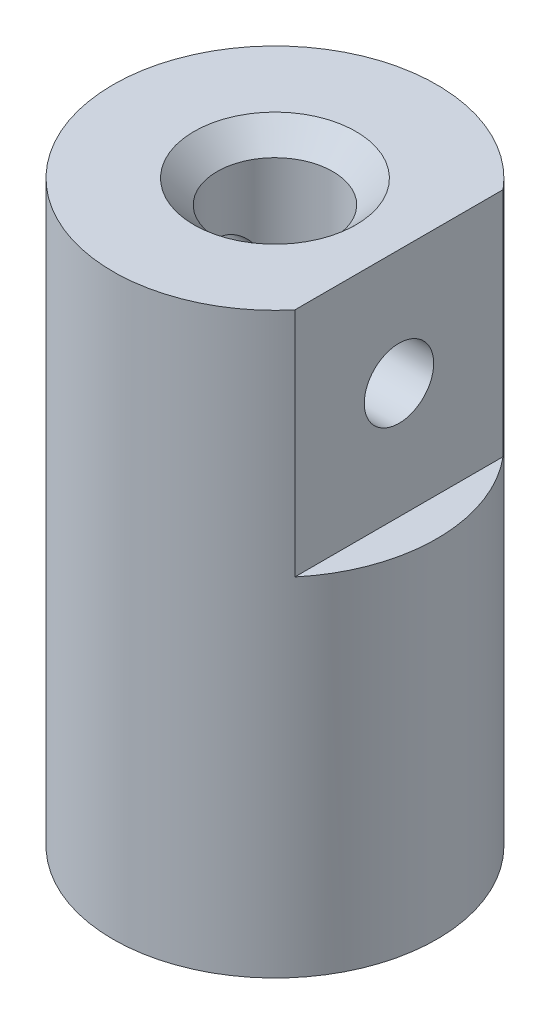
ISO-10303-21;
HEADER;
FILE_DESCRIPTION(('STEP AP214'),'2;1');
FILE_NAME('part.step','',(''),(''),'','','');
FILE_SCHEMA(('AUTOMOTIVE_DESIGN { 1 0 10303 214 1 1 1 1 }'));
ENDSEC;
DATA;
#1=APPLICATION_CONTEXT('core data for automotive mechanical design processes');
#2=APPLICATION_PROTOCOL_DEFINITION('international standard','automotive_design',2000,#1);
#3=PRODUCT_CONTEXT('',#1,'mechanical');
#4=PRODUCT('Part','Part','',(#3));
#5=PRODUCT_RELATED_PRODUCT_CATEGORY('part','',(#4));
#6=PRODUCT_DEFINITION_FORMATION('','',#4);
#7=PRODUCT_DEFINITION_CONTEXT('part definition',#1,'design');
#8=PRODUCT_DEFINITION('design','',#6,#7);
#9=PRODUCT_DEFINITION_SHAPE('','',#8);
#10=(LENGTH_UNIT() NAMED_UNIT(*) SI_UNIT(.MILLI.,.METRE.));
#11=(NAMED_UNIT(*) PLANE_ANGLE_UNIT() SI_UNIT($,.RADIAN.));
#12=(NAMED_UNIT(*) SI_UNIT($,.STERADIAN.) SOLID_ANGLE_UNIT());
#13=UNCERTAINTY_MEASURE_WITH_UNIT(LENGTH_MEASURE(1.E-05),#10,'distance_accuracy_value','');
#14=(GEOMETRIC_REPRESENTATION_CONTEXT(3) GLOBAL_UNCERTAINTY_ASSIGNED_CONTEXT((#13)) GLOBAL_UNIT_ASSIGNED_CONTEXT((#10,
#11,#12)) REPRESENTATION_CONTEXT('',''));
#15=CARTESIAN_POINT('',(0.,0.,0.));
#16=DIRECTION('',(0.,0.,1.));
#17=DIRECTION('',(1.,0.,0.));
#18=AXIS2_PLACEMENT_3D('',#15,#16,#17);
#19=CARTESIAN_POINT('',(0.,25.,0.));
#20=DIRECTION('',(0.,-1.,0.));
#21=DIRECTION('',(0.,0.,-1.));
#22=AXIS2_PLACEMENT_3D('',#19,#20,#21);
#23=CYLINDRICAL_SURFACE('',#22,7.);
#24=CARTESIAN_POINT('',(-7.,18.5,0.));
#25=CARTESIAN_POINT('',(-6.99999846043225,18.5000028995743,-0.0832358860906164));
#26=CARTESIAN_POINT('',(-6.9985002594971,18.5069516083879,-0.166507195600274));
#27=CARTESIAN_POINT('',(-6.99266829827728,18.5345356568536,-0.330687344293327));
#28=CARTESIAN_POINT('',(-6.98833245637099,18.5551810441949,-0.41159440357119));
#29=CARTESIAN_POINT('',(-6.97730831788826,18.609484364608,-0.568649323817737));
#30=CARTESIAN_POINT('',(-6.97062242967171,18.6431289793813,-0.644801963446556));
#31=CARTESIAN_POINT('',(-6.95562106817971,18.7224340861713,-0.790378177960788));
#32=CARTESIAN_POINT('',(-6.9473056503666,18.7680941692499,-0.85980198174737));
#33=CARTESIAN_POINT('',(-6.92981369246311,18.8708802996735,-0.991024790535229));
#34=CARTESIAN_POINT('',(-6.92062683143259,18.9281562218985,-1.05270503419445));
#35=CARTESIAN_POINT('',(-6.90250069814144,19.0522263156852,-1.16566042389435));
#36=CARTESIAN_POINT('',(-6.8935614473163,19.1190213082513,-1.21693467150908));
#37=CARTESIAN_POINT('',(-6.87684116047225,19.2611057528604,-1.30814204379809));
#38=CARTESIAN_POINT('',(-6.8690733634436,19.3364775177562,-1.34794958335009));
#39=CARTESIAN_POINT('',(-6.85572325558537,19.4930344537668,-1.41428823691148));
#40=CARTESIAN_POINT('',(-6.85014069470711,19.5742189584926,-1.44082087001716));
#41=CARTESIAN_POINT('',(-6.8418980892631,19.7388110865881,-1.47946574422455));
#42=CARTESIAN_POINT('',(-6.83919556896486,19.8221672756639,-1.49178779748343));
#43=CARTESIAN_POINT('',(-6.83689139845106,19.989804232507,-1.50231395206577));
#44=CARTESIAN_POINT('',(-6.83728938291729,20.0740848901799,-1.50051971664629));
#45=CARTESIAN_POINT('',(-6.84110276603832,20.2396246879338,-1.48303326340861));
#46=CARTESIAN_POINT('',(-6.84446541682162,20.3209108891002,-1.46758398649408));
#47=CARTESIAN_POINT('',(-6.85374593375787,20.4797102402893,-1.42361054298677));
#48=CARTESIAN_POINT('',(-6.85966393808402,20.5572231860323,-1.39508566936466));
#49=CARTESIAN_POINT('',(-6.87344080755724,20.7069628728733,-1.32554551075991));
#50=CARTESIAN_POINT('',(-6.88131420983365,20.7791445127126,-1.2844361097283));
#51=CARTESIAN_POINT('',(-6.89810572501288,20.915675164958,-1.19096007283993));
#52=CARTESIAN_POINT('',(-6.90702397481896,20.9800231486862,-1.13859196103562));
#53=CARTESIAN_POINT('',(-6.92512718393878,21.1004593556734,-1.0227954275532));
#54=CARTESIAN_POINT('',(-6.93431383972178,21.1563487065847,-0.959160233964411));
#55=CARTESIAN_POINT('',(-6.95175017497059,21.2566937336897,-0.823317306269097));
#56=CARTESIAN_POINT('',(-6.95999983875972,21.3011492186004,-0.7511094287754));
#57=CARTESIAN_POINT('',(-6.97465778534003,21.3774106799069,-0.59993346204996));
#58=CARTESIAN_POINT('',(-6.98106238643354,21.409191412578,-0.520952258863483));
#59=CARTESIAN_POINT('',(-6.99128109245334,21.4589756483211,-0.358603146685707));
#60=CARTESIAN_POINT('',(-6.99509555860384,21.4769810725633,-0.275235851133669));
#61=CARTESIAN_POINT('',(-6.99965306347808,21.4984162141434,-0.10818767083663));
#62=CARTESIAN_POINT('',(-7.00045336521066,21.5021177128818,-0.0245431772716158));
#63=CARTESIAN_POINT('',(-6.99905248935969,21.4955754288748,0.142168973650403));
#64=CARTESIAN_POINT('',(-6.99685150675698,21.4853325520371,0.225236668127253));
#65=CARTESIAN_POINT('',(-6.98973143045266,21.4514177563383,0.387542537982804));
#66=CARTESIAN_POINT('',(-6.98484105045459,21.4278876305275,0.466811712908476));
#67=CARTESIAN_POINT('',(-6.9728892442151,21.3682230570052,0.620278450473417));
#68=CARTESIAN_POINT('',(-6.96582763822237,21.3320875656883,0.694475592587738));
#69=CARTESIAN_POINT('',(-6.950175043904,21.2476664569397,0.836821397964752));
#70=CARTESIAN_POINT('',(-6.94156431354275,21.1992202050903,0.904872575111139));
#71=CARTESIAN_POINT('',(-6.92381033034847,21.0917651751113,1.03197692552359));
#72=CARTESIAN_POINT('',(-6.91466701142097,21.0327550841126,1.091028978692));
#73=CARTESIAN_POINT('',(-6.89668172706324,20.9046026298129,1.19952711057989));
#74=CARTESIAN_POINT('',(-6.88784792221285,20.8352999007779,1.24878537255157));
#75=CARTESIAN_POINT('',(-6.87166654559681,20.689245403522,1.3349641538604));
#76=CARTESIAN_POINT('',(-6.86431891048055,20.6124939530225,1.37188519913705));
#77=CARTESIAN_POINT('',(-6.8520100980739,20.4541277010054,1.43209741248548));
#78=CARTESIAN_POINT('',(-6.84703574582967,20.3725426435693,1.45546398641275));
#79=CARTESIAN_POINT('',(-6.84001186708418,20.2064844161664,1.48812696085335));
#80=CARTESIAN_POINT('',(-6.83796189439706,20.1220116887987,1.49742550780258));
#81=CARTESIAN_POINT('',(-6.83704618848155,19.9544676568248,1.5015999992604));
#82=CARTESIAN_POINT('',(-6.83811476518543,19.8714039850194,1.49677347258311));
#83=CARTESIAN_POINT('',(-6.8431676318483,19.7073027578674,1.47349789406331));
#84=CARTESIAN_POINT('',(-6.84715189026714,19.6262651806134,1.45504898957979));
#85=CARTESIAN_POINT('',(-6.85755581104157,19.4687413421308,1.40519345940434));
#86=CARTESIAN_POINT('',(-6.86396764224703,19.3922413513357,1.37382847170887));
#87=CARTESIAN_POINT('',(-6.87850764590649,19.2455446274931,1.29906751595601));
#88=CARTESIAN_POINT('',(-6.88663598880363,19.175348521385,1.255670353015));
#89=CARTESIAN_POINT('',(-6.90389055593232,19.0417818062746,1.15708290349304));
#90=CARTESIAN_POINT('',(-6.91303309938926,18.978570304053,1.10167987421237));
#91=CARTESIAN_POINT('',(-6.93117449799694,18.8622437374795,0.981086554619621));
#92=CARTESIAN_POINT('',(-6.94017331951296,18.8091310056878,0.915894009385597));
#93=CARTESIAN_POINT('',(-6.95714491048987,18.7138840404944,0.776603147268717));
#94=CARTESIAN_POINT('',(-6.96510364570626,18.671893393769,0.702404846009642));
#95=CARTESIAN_POINT('',(-6.97895826104019,18.6010454710938,0.547850160940598));
#96=CARTESIAN_POINT('',(-6.98485590212342,18.572176977415,0.46749910586388));
#97=CARTESIAN_POINT('',(-6.99284848461772,18.5336478148688,0.322535217553204));
#98=CARTESIAN_POINT('',(-6.99551391888263,18.52105356602,0.258717205545979));
#99=CARTESIAN_POINT('',(-6.99909024154719,18.5042286982883,0.129939960853847));
#100=CARTESIAN_POINT('',(-7.00000120191314,18.4999977363539,0.0649807750887452));
#101=CARTESIAN_POINT('',(-7.,18.5,0.));
#102=B_SPLINE_CURVE_WITH_KNOTS('',3,(#24,#25,#26,#27,#28,#29,#30,#31,#32,#33,#34,#35,#36,#37,
#38,#39,#40,#41,#42,#43,#44,#45,#46,#47,#48,#49,#50,#51,#52,#53,#54,#55,#56,#57,#58,#59,#60,#61,
#62,#63,#64,#65,#66,#67,#68,#69,#70,#71,#72,#73,#74,#75,#76,#77,#78,#79,#80,#81,#82,#83,#84,#85,
#86,#87,#88,#89,#90,#91,#92,#93,#94,#95,#96,#97,#98,#99,#100,#101),.UNSPECIFIED.,.T.,.F.,(4,2,2,
2,2,2,2,2,2,2,2,2,2,2,2,2,2,2,2,2,2,2,2,2,2,2,2,2,2,2,2,2,2,2,2,2,2,2,4),(0.,0.249469836512082,
0.499122883219936,0.748520824425602,0.997910278645885,1.25074961881732,1.50361077918506,
1.7591442921451,2.01464855677489,2.26633008124666,2.51798195169165,2.76524475452928,
3.01252092904568,3.26169356165968,3.51089887920889,3.76527011050291,4.0196455970235,
4.27452521139806,4.52936927256344,4.77934665704185,5.02930780231429,5.27665060589267,
5.52401389198434,5.77478733867803,6.02559197304485,6.28082063283534,6.53603841075805,
6.78982240408474,7.04356767229185,7.29200680540294,7.5404432510827,7.78808499706786,
8.03575134451624,8.28822950154114,8.54076590397115,8.79641910357222,9.05185334010271,
9.24661799132294,9.44137465337336),.UNSPECIFIED.);
#103=CARTESIAN_POINT('',(-7.,18.5,0.));
#104=VERTEX_POINT('',#103);
#105=EDGE_CURVE('E66',#104,#104,#102,.T.);
#106=ORIENTED_EDGE('',*,*,#105,.T.);
#107=EDGE_LOOP('',(#106));
#108=FACE_BOUND('',#107,.T.);
#109=CARTESIAN_POINT('',(0.,25.,0.));
#110=DIRECTION('',(0.,1.,0.));
#111=DIRECTION('',(0.,0.,1.));
#112=AXIS2_PLACEMENT_3D('',#109,#110,#111);
#113=CIRCLE('',#112,7.);
#114=CARTESIAN_POINT('',(5.3619026473818,25.,-4.5));
#115=VERTEX_POINT('',#114);
#116=CARTESIAN_POINT('',(5.3619026473818,25.,4.5));
#117=VERTEX_POINT('',#116);
#118=EDGE_CURVE('E71',#115,#117,#113,.T.);
#119=ORIENTED_EDGE('',*,*,#118,.F.);
#120=DIRECTION('',(0.,1.,0.));
#121=VECTOR('',#120,1.);
#122=CARTESIAN_POINT('',(5.3619026473818,15.,-4.5));
#123=LINE('',#122,#121);
#124=CARTESIAN_POINT('',(5.3619026473818,15.,-4.5));
#125=VERTEX_POINT('',#124);
#126=EDGE_CURVE('E49',#125,#115,#123,.T.);
#127=ORIENTED_EDGE('',*,*,#126,.F.);
#128=CARTESIAN_POINT('',(0.,15.,0.));
#129=DIRECTION('',(0.,1.,0.));
#130=DIRECTION('',(0.,0.,1.));
#131=AXIS2_PLACEMENT_3D('',#128,#129,#130);
#132=CIRCLE('',#131,7.);
#133=CARTESIAN_POINT('',(5.3619026473818,15.,4.5));
#134=VERTEX_POINT('',#133);
#135=EDGE_CURVE('E65',#134,#125,#132,.T.);
#136=ORIENTED_EDGE('',*,*,#135,.F.);
#137=DIRECTION('',(0.,1.,0.));
#138=VECTOR('',#137,1.);
#139=CARTESIAN_POINT('',(5.3619026473818,15.,4.5));
#140=LINE('',#139,#138);
#141=EDGE_CURVE('E55',#134,#117,#140,.T.);
#142=ORIENTED_EDGE('',*,*,#141,.T.);
#143=EDGE_LOOP('',(#119,#127,#136,#142));
#144=FACE_BOUND('',#143,.T.);
#145=CARTESIAN_POINT('',(0.,0.,0.));
#146=DIRECTION('',(0.,1.,0.));
#147=DIRECTION('',(0.,0.,1.));
#148=AXIS2_PLACEMENT_3D('',#145,#146,#147);
#149=CIRCLE('',#148,7.);
#150=CARTESIAN_POINT('',(0.,0.,7.));
#151=VERTEX_POINT('',#150);
#152=EDGE_CURVE('E72',#151,#151,#149,.T.);
#153=ORIENTED_EDGE('',*,*,#152,.T.);
#154=EDGE_LOOP('',(#153));
#155=FACE_BOUND('',#154,.T.);
#156=ADVANCED_FACE('F34',(#108,#144,#155),#23,.T.);
#157=CARTESIAN_POINT('',(0.,25.,0.));
#158=DIRECTION('',(0.,1.,0.));
#159=DIRECTION('',(0.,0.,1.));
#160=AXIS2_PLACEMENT_3D('',#157,#158,#159);
#161=PLANE('',#160);
#162=DIRECTION('',(0.,0.,1.));
#163=VECTOR('',#162,1.);
#164=CARTESIAN_POINT('',(5.3619026473818,25.,0.));
#165=LINE('',#164,#163);
#166=EDGE_CURVE('E60',#115,#117,#165,.T.);
#167=ORIENTED_EDGE('',*,*,#166,.F.);
#168=ORIENTED_EDGE('',*,*,#118,.T.);
#169=EDGE_LOOP('',(#167,#168));
#170=FACE_BOUND('',#169,.T.);
#171=CARTESIAN_POINT('',(0.,25.,0.));
#172=DIRECTION('',(0.,1.,0.));
#173=DIRECTION('',(0.,0.,1.));
#174=AXIS2_PLACEMENT_3D('',#171,#172,#173);
#175=CIRCLE('',#174,3.49999999999999);
#176=CARTESIAN_POINT('',(0.,25.,3.49999999999999));
#177=VERTEX_POINT('',#176);
#178=EDGE_CURVE('E42',#177,#177,#175,.F.);
#179=ORIENTED_EDGE('',*,*,#178,.T.);
#180=EDGE_LOOP('',(#179));
#181=FACE_BOUND('',#180,.T.);
#182=ADVANCED_FACE('F74',(#170,#181),#161,.T.);
#183=CARTESIAN_POINT('',(0.,0.,0.));
#184=DIRECTION('',(0.,1.,0.));
#185=DIRECTION('',(0.,0.,1.));
#186=AXIS2_PLACEMENT_3D('',#183,#184,#185);
#187=PLANE('',#186);
#188=CARTESIAN_POINT('',(0.,0.,0.));
#189=DIRECTION('',(0.,1.,0.));
#190=DIRECTION('',(0.,0.,1.));
#191=AXIS2_PLACEMENT_3D('',#188,#189,#190);
#192=CIRCLE('',#191,3.00000000000001);
#193=CARTESIAN_POINT('',(0.,0.,3.00000000000001));
#194=VERTEX_POINT('',#193);
#195=EDGE_CURVE('E79',#194,#194,#192,.T.);
#196=ORIENTED_EDGE('',*,*,#195,.T.);
#197=EDGE_LOOP('',(#196));
#198=FACE_BOUND('',#197,.T.);
#199=ORIENTED_EDGE('',*,*,#152,.F.);
#200=EDGE_LOOP('',(#199));
#201=FACE_BOUND('',#200,.T.);
#202=ADVANCED_FACE('F108',(#198,#201),#187,.F.);
#203=CARTESIAN_POINT('',(0.,25.001,0.));
#204=DIRECTION('',(0.,-1.,0.));
#205=DIRECTION('',(0.,0.,-1.));
#206=AXIS2_PLACEMENT_3D('',#203,#204,#205);
#207=CYLINDRICAL_SURFACE('',#206,2.5);
#208=CARTESIAN_POINT('',(-2.,20.,-1.5));
#209=CARTESIAN_POINT('',(-1.99999416642511,19.9245210247104,-1.50000404108592));
#210=CARTESIAN_POINT('',(-2.00433633903481,19.8490615659202,-1.49426852824014));
#211=CARTESIAN_POINT('',(-2.02092590613883,19.7006760960378,-1.47174965152787));
#212=CARTESIAN_POINT('',(-2.03318155043097,19.6277528126149,-1.45495475788936));
#213=CARTESIAN_POINT('',(-2.0636233903473,19.4869163583227,-1.41143486335796));
#214=CARTESIAN_POINT('',(-2.08176666183119,19.4189711619647,-1.3847815450315));
#215=CARTESIAN_POINT('',(-2.12185904995836,19.2885625466321,-1.3225290928302));
#216=CARTESIAN_POINT('',(-2.14380930122416,19.2261007703049,-1.28692729054694));
#217=CARTESIAN_POINT('',(-2.19228594587542,19.1000509833359,-1.20271292747644));
#218=CARTESIAN_POINT('',(-2.21904371037662,19.0372590428761,-1.15304179435289));
#219=CARTESIAN_POINT('',(-2.27226229431061,18.9202352372582,-1.04426801309985));
#220=CARTESIAN_POINT('',(-2.29872287517103,18.8660098483292,-0.985158296729612));
#221=CARTESIAN_POINT('',(-2.35175567858734,18.7618661902903,-0.851442367411701));
#222=CARTESIAN_POINT('',(-2.37803133577818,18.7130455363302,-0.775851995162548));
#223=CARTESIAN_POINT('',(-2.42443786983179,18.6291902775556,-0.615654228271659));
#224=CARTESIAN_POINT('',(-2.44457437988735,18.5941430258773,-0.531055196626331));
#225=CARTESIAN_POINT('',(-2.4747098780044,18.5424040771874,-0.363771406742668));
#226=CARTESIAN_POINT('',(-2.4854930393917,18.5242796390327,-0.281674698130917));
#227=CARTESIAN_POINT('',(-2.49874939277545,18.5020571971369,-0.114970509382709));
#228=CARTESIAN_POINT('',(-2.50123038813307,18.4979460219999,-0.0303654624001545));
#229=CARTESIAN_POINT('',(-2.49783372711539,18.5036137473425,0.127637283737309));
#230=CARTESIAN_POINT('',(-2.49295437513726,18.5117335261693,0.201123832865634));
#231=CARTESIAN_POINT('',(-2.47707997553857,18.5384797956481,0.345464269151767));
#232=CARTESIAN_POINT('',(-2.46608447529309,18.5571070639072,0.416317961051201));
#233=CARTESIAN_POINT('',(-2.43884907201719,18.6041655627038,0.554056780469079));
#234=CARTESIAN_POINT('',(-2.42257910450824,18.632653061139,0.620916491037618));
#235=CARTESIAN_POINT('',(-2.38609637638748,18.6983846162255,0.748988660115612));
#236=CARTESIAN_POINT('',(-2.36588259201812,18.735630947059,0.810199646208011));
#237=CARTESIAN_POINT('',(-2.32037925976363,18.8228390928045,0.933074267143199));
#238=CARTESIAN_POINT('',(-2.2947718295215,18.8737883117357,0.993918663198192));
#239=CARTESIAN_POINT('',(-2.24255554245601,18.9844041178602,1.10671465909274));
#240=CARTESIAN_POINT('',(-2.21594536703375,19.0440825034745,1.15865401308339));
#241=CARTESIAN_POINT('',(-2.16111075123946,19.1786534061636,1.25824837767417));
#242=CARTESIAN_POINT('',(-2.13305661385124,19.2545075765395,1.30470933188632));
#243=CARTESIAN_POINT('',(-2.08250879557267,19.4147062316366,1.38397217194232));
#244=CARTESIAN_POINT('',(-2.0600049029882,19.4990347161256,1.41679921962189));
#245=CARTESIAN_POINT('',(-2.02895865196731,19.6523936318954,1.46077497064842));
#246=CARTESIAN_POINT('',(-2.01833888618316,19.7200406322966,1.47527903312665));
#247=CARTESIAN_POINT('',(-2.00392150777558,19.8573736102995,1.49480872755284));
#248=CARTESIAN_POINT('',(-2.00011596115116,19.9270571204846,1.49984538302907));
#249=CARTESIAN_POINT('',(-1.99988914321323,20.0665516824357,1.50014781114183));
#250=CARTESIAN_POINT('',(-2.00347810223984,20.1363627772152,1.49540004697659));
#251=CARTESIAN_POINT('',(-2.01751520788652,20.2739873437486,1.47640290574941));
#252=CARTESIAN_POINT('',(-2.02796877613213,20.3417991922403,1.46214601830139));
#253=CARTESIAN_POINT('',(-2.054317683331,20.4737145794798,1.42488312618657));
#254=CARTESIAN_POINT('',(-2.07020622092812,20.5378226365322,1.40188805257362));
#255=CARTESIAN_POINT('',(-2.10571539417587,20.6614777157302,1.34796261057072));
#256=CARTESIAN_POINT('',(-2.12533743689999,20.721023006366,1.31702924888212));
#257=CARTESIAN_POINT('',(-2.17036819177737,20.8452400825123,1.24167439558512));
#258=CARTESIAN_POINT('',(-2.19618239397369,20.9089008350966,1.19582663060302));
#259=CARTESIAN_POINT('',(-2.24821754803621,21.0282854848495,1.094873955187));
#260=CARTESIAN_POINT('',(-2.27443886711455,21.0840016921691,1.03976018672402));
#261=CARTESIAN_POINT('',(-2.32835625910913,21.1932240073504,0.913274837212764));
#262=CARTESIAN_POINT('',(-2.3558007587587,21.2455007266058,0.840721108780188));
#263=CARTESIAN_POINT('',(-2.40537639133459,21.3369027768367,0.686103100868015));
#264=CARTESIAN_POINT('',(-2.42751104449411,21.3760368278409,0.604045176134697));
#265=CARTESIAN_POINT('',(-2.46252280092775,21.4368682034314,0.438840232972132));
#266=CARTESIAN_POINT('',(-2.47595588067329,21.4596262277911,0.356205963651252));
#267=CARTESIAN_POINT('',(-2.494407389061,21.4907146028463,0.187383063890851));
#268=CARTESIAN_POINT('',(-2.49943534582737,21.4990612907176,0.101198571781962));
#269=CARTESIAN_POINT('',(-2.50040600461976,21.5006746085859,-0.0598120232009899));
#270=CARTESIAN_POINT('',(-2.49747057186327,21.495803334563,-0.134620583589712));
#271=CARTESIAN_POINT('',(-2.48512948412095,21.4751061756184,-0.282148755978779));
#272=CARTESIAN_POINT('',(-2.47572375706639,21.4592801686784,-0.354868344701919));
#273=CARTESIAN_POINT('',(-2.45149427526962,21.4177804284162,-0.495145481978802));
#274=CARTESIAN_POINT('',(-2.43675966858906,21.3922684038708,-0.562767032608834));
#275=CARTESIAN_POINT('',(-2.40303337447155,21.3323594054452,-0.692781971999988));
#276=CARTESIAN_POINT('',(-2.38404073252268,21.2979604391404,-0.755174184199836));
#277=CARTESIAN_POINT('',(-2.3409343265938,21.2170748034312,-0.880263645295952));
#278=CARTESIAN_POINT('',(-2.31648844639149,21.1696812909831,-0.942258690439945));
#279=CARTESIAN_POINT('',(-2.26601907350661,21.0662469662823,-1.05789751536307));
#280=CARTESIAN_POINT('',(-2.23999385274509,21.0101965743921,-1.11153190956916));
#281=CARTESIAN_POINT('',(-2.18528165666204,20.8827144378223,-1.2159097535057));
#282=CARTESIAN_POINT('',(-2.15667566270901,20.8102335138345,-1.26542406663368));
#283=CARTESIAN_POINT('',(-2.10376464485145,20.6565151472335,-1.35156817210325));
#284=CARTESIAN_POINT('',(-2.07945738811052,20.5752822860186,-1.38820466322661));
#285=CARTESIAN_POINT('',(-2.0408000304796,20.4129357148628,-1.44437116535132));
#286=CARTESIAN_POINT('',(-2.02577665830138,20.3324047640387,-1.46509526060187));
#287=CARTESIAN_POINT('',(-2.00539032320036,20.1679026052963,-1.49289268240426));
#288=CARTESIAN_POINT('',(-2.00000648744643,20.0839392342413,-1.49999550595837));
#289=CARTESIAN_POINT('',(-2.,20.,-1.5));
#290=B_SPLINE_CURVE_WITH_KNOTS('',3,(#208,#209,#210,#211,#212,#213,#214,#215,#216,#217,#218,
#219,#220,#221,#222,#223,#224,#225,#226,#227,#228,#229,#230,#231,#232,#233,#234,#235,#236,#237,
#238,#239,#240,#241,#242,#243,#244,#245,#246,#247,#248,#249,#250,#251,#252,#253,#254,#255,#256,
#257,#258,#259,#260,#261,#262,#263,#264,#265,#266,#267,#268,#269,#270,#271,#272,#273,#274,#275,
#276,#277,#278,#279,#280,#281,#282,#283,#284,#285,#286,#287,#288,#289),.UNSPECIFIED.,.T.,.F.,(4,
2,2,2,2,2,2,2,2,2,2,2,2,2,2,2,2,2,2,2,2,2,2,2,2,2,2,2,2,2,2,2,2,2,2,2,2,2,2,2,4),(0.,
0.22608524949339,0.452406574330771,0.677113624991876,0.90188776221593,1.15414462390002,
1.40659128601844,1.68630157736223,1.9657544327122,2.21853330858497,2.47107452602767,
2.69230130543182,2.91354445887945,3.13607155036377,3.35865648368878,3.60782810055849,
3.85733966656908,4.13576671140276,4.41367760154768,4.62276298054684,4.83160475643977,
5.04073566011182,5.25003193304128,5.45906724365496,5.66818149154662,5.91499438482003,
6.16204457978455,6.44121828011589,6.72020638384848,6.97891479383338,7.23732973022727,
7.461293218494,7.68525920139649,7.90563970188757,8.12606965394585,8.37042963549488,
8.61506198741956,8.89071695766605,9.16622832484806,9.41820120134354,9.66962780912277),.UNSPECIFIED.);
#291=CARTESIAN_POINT('',(-2.,20.,-1.5));
#292=VERTEX_POINT('',#291);
#293=EDGE_CURVE('E119',#292,#292,#290,.T.);
#294=ORIENTED_EDGE('',*,*,#293,.T.);
#295=EDGE_LOOP('',(#294));
#296=FACE_BOUND('',#295,.T.);
#297=CARTESIAN_POINT('',(2.,20.,-1.5));
#298=CARTESIAN_POINT('',(1.99999416642511,20.0754789752896,-1.50000404108592));
#299=CARTESIAN_POINT('',(2.00433633903481,20.1509384340798,-1.49426852824014));
#300=CARTESIAN_POINT('',(2.02092590613883,20.2993239039622,-1.47174965152787));
#301=CARTESIAN_POINT('',(2.03318155043097,20.3722471873851,-1.45495475788936));
#302=CARTESIAN_POINT('',(2.0636233903473,20.5130836416773,-1.41143486335796));
#303=CARTESIAN_POINT('',(2.08176666183119,20.5810288380353,-1.3847815450315));
#304=CARTESIAN_POINT('',(2.12185904995836,20.7114374533679,-1.3225290928302));
#305=CARTESIAN_POINT('',(2.14380930122416,20.7738992296951,-1.28692729054694));
#306=CARTESIAN_POINT('',(2.19228594587542,20.8999490166641,-1.20271292747644));
#307=CARTESIAN_POINT('',(2.21904371037662,20.9627409571239,-1.15304179435289));
#308=CARTESIAN_POINT('',(2.27226229431061,21.0797647627418,-1.04426801309985));
#309=CARTESIAN_POINT('',(2.29872287517103,21.1339901516708,-0.985158296729613));
#310=CARTESIAN_POINT('',(2.35175567858734,21.2381338097097,-0.851442367411701));
#311=CARTESIAN_POINT('',(2.37803133577818,21.2869544636698,-0.775851995162548));
#312=CARTESIAN_POINT('',(2.42443786983179,21.3708097224444,-0.615654228271659));
#313=CARTESIAN_POINT('',(2.44457437988735,21.4058569741227,-0.531055196626331));
#314=CARTESIAN_POINT('',(2.4747098780044,21.4575959228126,-0.363771406742668));
#315=CARTESIAN_POINT('',(2.4854930393917,21.4757203609673,-0.281674698130917));
#316=CARTESIAN_POINT('',(2.49874939277545,21.4979428028631,-0.114970509382709));
#317=CARTESIAN_POINT('',(2.50123038813307,21.5020539780001,-0.0303654624001545));
#318=CARTESIAN_POINT('',(2.49783372711539,21.4963862526575,0.127637283737309));
#319=CARTESIAN_POINT('',(2.49295437513726,21.4882664738307,0.201123832865635));
#320=CARTESIAN_POINT('',(2.47707997553857,21.4615202043519,0.345464269151768));
#321=CARTESIAN_POINT('',(2.46608447529309,21.4428929360928,0.416317961051201));
#322=CARTESIAN_POINT('',(2.43884907201719,21.3958344372962,0.554056780469079));
#323=CARTESIAN_POINT('',(2.42257910450824,21.367346938861,0.620916491037618));
#324=CARTESIAN_POINT('',(2.38609637638748,21.3016153837745,0.748988660115612));
#325=CARTESIAN_POINT('',(2.36588259201812,21.264369052941,0.810199646208011));
#326=CARTESIAN_POINT('',(2.32037925976363,21.1771609071955,0.933074267143199));
#327=CARTESIAN_POINT('',(2.2947718295215,21.1262116882643,0.993918663198192));
#328=CARTESIAN_POINT('',(2.24255554245601,21.0155958821398,1.10671465909274));
#329=CARTESIAN_POINT('',(2.21594536703375,20.9559174965255,1.15865401308339));
#330=CARTESIAN_POINT('',(2.16111075123946,20.8213465938364,1.25824837767417));
#331=CARTESIAN_POINT('',(2.13305661385124,20.7454924234605,1.30470933188632));
#332=CARTESIAN_POINT('',(2.08250879557267,20.5852937683634,1.38397217194232));
#333=CARTESIAN_POINT('',(2.0600049029882,20.5009652838744,1.41679921962189));
#334=CARTESIAN_POINT('',(2.02895865196731,20.3476063681047,1.46077497064842));
#335=CARTESIAN_POINT('',(2.01833888618316,20.2799593677034,1.47527903312665));
#336=CARTESIAN_POINT('',(2.00392150777558,20.1426263897005,1.49480872755284));
#337=CARTESIAN_POINT('',(2.00011596115116,20.0729428795154,1.49984538302907));
#338=CARTESIAN_POINT('',(1.99988914321323,19.9334483175643,1.50014781114183));
#339=CARTESIAN_POINT('',(2.00347810223984,19.8636372227848,1.49540004697659));
#340=CARTESIAN_POINT('',(2.01751520788652,19.7260126562514,1.47640290574941));
#341=CARTESIAN_POINT('',(2.02796877613213,19.6582008077597,1.46214601830139));
#342=CARTESIAN_POINT('',(2.054317683331,19.5262854205202,1.42488312618657));
#343=CARTESIAN_POINT('',(2.07020622092812,19.4621773634678,1.40188805257362));
#344=CARTESIAN_POINT('',(2.10571539417587,19.3385222842698,1.34796261057072));
#345=CARTESIAN_POINT('',(2.12533743689999,19.278976993634,1.31702924888212));
#346=CARTESIAN_POINT('',(2.17036819177737,19.1547599174877,1.24167439558512));
#347=CARTESIAN_POINT('',(2.19618239397369,19.0910991649034,1.19582663060302));
#348=CARTESIAN_POINT('',(2.24821754803621,18.9717145151505,1.094873955187));
#349=CARTESIAN_POINT('',(2.27443886711455,18.9159983078309,1.03976018672402));
#350=CARTESIAN_POINT('',(2.32835625910913,18.8067759926496,0.913274837212764));
#351=CARTESIAN_POINT('',(2.3558007587587,18.7544992733942,0.840721108780188));
#352=CARTESIAN_POINT('',(2.40537639133459,18.6630972231633,0.686103100868015));
#353=CARTESIAN_POINT('',(2.42751104449411,18.6239631721591,0.604045176134697));
#354=CARTESIAN_POINT('',(2.46252280092775,18.5631317965686,0.438840232972132));
#355=CARTESIAN_POINT('',(2.47595588067329,18.5403737722089,0.356205963651252));
#356=CARTESIAN_POINT('',(2.494407389061,18.5092853971537,0.18738306389085));
#357=CARTESIAN_POINT('',(2.49943534582737,18.5009387092824,0.101198571781962));
#358=CARTESIAN_POINT('',(2.50040600461976,18.4993253914141,-0.0598120232009899));
#359=CARTESIAN_POINT('',(2.49747057186327,18.504196665437,-0.134620583589712));
#360=CARTESIAN_POINT('',(2.48512948412095,18.5248938243816,-0.282148755978779));
#361=CARTESIAN_POINT('',(2.47572375706639,18.5407198313216,-0.354868344701919));
#362=CARTESIAN_POINT('',(2.45149427526962,18.5822195715838,-0.495145481978801));
#363=CARTESIAN_POINT('',(2.43675966858906,18.6077315961292,-0.562767032608833));
#364=CARTESIAN_POINT('',(2.40303337447155,18.6676405945548,-0.692781971999987));
#365=CARTESIAN_POINT('',(2.38404073252268,18.7020395608596,-0.755174184199836));
#366=CARTESIAN_POINT('',(2.3409343265938,18.7829251965688,-0.880263645295952));
#367=CARTESIAN_POINT('',(2.31648844639149,18.8303187090169,-0.942258690439945));
#368=CARTESIAN_POINT('',(2.26601907350661,18.9337530337177,-1.05789751536307));
#369=CARTESIAN_POINT('',(2.23999385274509,18.9898034256079,-1.11153190956916));
#370=CARTESIAN_POINT('',(2.18528165666204,19.1172855621777,-1.2159097535057));
#371=CARTESIAN_POINT('',(2.15667566270901,19.1897664861655,-1.26542406663368));
#372=CARTESIAN_POINT('',(2.10376464485145,19.3434848527665,-1.35156817210325));
#373=CARTESIAN_POINT('',(2.07945738811052,19.4247177139814,-1.38820466322661));
#374=CARTESIAN_POINT('',(2.0408000304796,19.5870642851372,-1.44437116535132));
#375=CARTESIAN_POINT('',(2.02577665830138,19.6675952359613,-1.46509526060187));
#376=CARTESIAN_POINT('',(2.00539032320036,19.8320973947037,-1.49289268240426));
#377=CARTESIAN_POINT('',(2.00000648744643,19.9160607657587,-1.49999550595837));
#378=CARTESIAN_POINT('',(2.,20.,-1.5));
#379=B_SPLINE_CURVE_WITH_KNOTS('',3,(#297,#298,#299,#300,#301,#302,#303,#304,#305,#306,#307,
#308,#309,#310,#311,#312,#313,#314,#315,#316,#317,#318,#319,#320,#321,#322,#323,#324,#325,#326,
#327,#328,#329,#330,#331,#332,#333,#334,#335,#336,#337,#338,#339,#340,#341,#342,#343,#344,#345,
#346,#347,#348,#349,#350,#351,#352,#353,#354,#355,#356,#357,#358,#359,#360,#361,#362,#363,#364,
#365,#366,#367,#368,#369,#370,#371,#372,#373,#374,#375,#376,#377,#378),.UNSPECIFIED.,.T.,.F.,(4,
2,2,2,2,2,2,2,2,2,2,2,2,2,2,2,2,2,2,2,2,2,2,2,2,2,2,2,2,2,2,2,2,2,2,2,2,2,2,2,4),(0.,
0.22608524949339,0.452406574330771,0.677113624991876,0.90188776221593,1.15414462390001,
1.40659128601844,1.68630157736223,1.9657544327122,2.21853330858497,2.47107452602767,
2.69230130543182,2.91354445887945,3.13607155036377,3.35865648368878,3.60782810055849,
3.85733966656908,4.13576671140276,4.41367760154768,4.62276298054684,4.83160475643977,
5.04073566011182,5.25003193304128,5.45906724365495,5.66818149154662,5.91499438482003,
6.16204457978455,6.44121828011589,6.72020638384848,6.97891479383338,7.23732973022727,
7.461293218494,7.68525920139649,7.90563970188756,8.12606965394585,8.37042963549488,
8.61506198741955,8.89071695766605,9.16622832484806,9.41820120134354,9.66962780912277),.UNSPECIFIED.);
#380=CARTESIAN_POINT('',(2.,20.,-1.5));
#381=VERTEX_POINT('',#380);
#382=EDGE_CURVE('E133',#381,#381,#379,.T.);
#383=ORIENTED_EDGE('',*,*,#382,.T.);
#384=EDGE_LOOP('',(#383));
#385=FACE_BOUND('',#384,.T.);
#386=CARTESIAN_POINT('',(0.,24.,0.));
#387=DIRECTION('',(0.,1.,0.));
#388=DIRECTION('',(0.,0.,1.));
#389=AXIS2_PLACEMENT_3D('',#386,#387,#388);
#390=CIRCLE('',#389,2.5);
#391=CARTESIAN_POINT('',(0.,24.,2.5));
#392=VERTEX_POINT('',#391);
#393=EDGE_CURVE('E11',#392,#392,#390,.T.);
#394=ORIENTED_EDGE('',*,*,#393,.T.);
#395=EDGE_LOOP('',(#394));
#396=FACE_BOUND('',#395,.T.);
#397=CARTESIAN_POINT('',(0.,0.5,0.));
#398=DIRECTION('',(0.,1.,0.));
#399=DIRECTION('',(0.,0.,1.));
#400=AXIS2_PLACEMENT_3D('',#397,#398,#399);
#401=CIRCLE('',#400,2.5);
#402=CARTESIAN_POINT('',(0.,0.5,2.5));
#403=VERTEX_POINT('',#402);
#404=EDGE_CURVE('E76',#403,#403,#401,.F.);
#405=ORIENTED_EDGE('',*,*,#404,.T.);
#406=EDGE_LOOP('',(#405));
#407=FACE_BOUND('',#406,.T.);
#408=ADVANCED_FACE('F99',(#296,#385,#396,#407),#207,.F.);
#409=CARTESIAN_POINT('',(0.,0.5,0.));
#410=DIRECTION('',(0.,-1.,0.));
#411=DIRECTION('',(0.,0.,-1.));
#412=AXIS2_PLACEMENT_3D('',#409,#410,#411);
#413=CONICAL_SURFACE('',#412,2.5,0.785398163397454);
#414=ORIENTED_EDGE('',*,*,#195,.F.);
#415=EDGE_LOOP('',(#414));
#416=FACE_BOUND('',#415,.T.);
#417=ORIENTED_EDGE('',*,*,#404,.F.);
#418=EDGE_LOOP('',(#417));
#419=FACE_BOUND('',#418,.T.);
#420=ADVANCED_FACE('F90',(#416,#419),#413,.F.);
#421=CARTESIAN_POINT('',(0.,25.,0.));
#422=DIRECTION('',(0.,1.,0.));
#423=DIRECTION('',(0.,0.,1.));
#424=AXIS2_PLACEMENT_3D('',#421,#422,#423);
#425=CONICAL_SURFACE('',#424,3.49999999999999,0.785398163397446);
#426=ORIENTED_EDGE('',*,*,#393,.F.);
#427=EDGE_LOOP('',(#426));
#428=FACE_BOUND('',#427,.T.);
#429=ORIENTED_EDGE('',*,*,#178,.F.);
#430=EDGE_LOOP('',(#429));
#431=FACE_BOUND('',#430,.T.);
#432=ADVANCED_FACE('F36',(#428,#431),#425,.F.);
#433=CARTESIAN_POINT('',(5.3619026473818,15.,0.));
#434=DIRECTION('',(-1.,0.,0.));
#435=DIRECTION('',(0.,0.,1.));
#436=AXIS2_PLACEMENT_3D('',#433,#434,#435);
#437=PLANE('',#436);
#438=CARTESIAN_POINT('',(5.3619026473818,20.,0.));
#439=DIRECTION('',(1.,0.,0.));
#440=DIRECTION('',(0.,0.,-1.));
#441=AXIS2_PLACEMENT_3D('',#438,#439,#440);
#442=CIRCLE('',#441,1.5);
#443=CARTESIAN_POINT('',(5.3619026473818,20.,-1.5));
#444=VERTEX_POINT('',#443);
#445=EDGE_CURVE('E138',#444,#444,#442,.T.);
#446=ORIENTED_EDGE('',*,*,#445,.F.);
#447=EDGE_LOOP('',(#446));
#448=FACE_BOUND('',#447,.T.);
#449=ORIENTED_EDGE('',*,*,#166,.T.);
#450=ORIENTED_EDGE('',*,*,#141,.F.);
#451=DIRECTION('',(0.,0.,1.));
#452=VECTOR('',#451,1.);
#453=CARTESIAN_POINT('',(5.3619026473818,15.,0.));
#454=LINE('',#453,#452);
#455=EDGE_CURVE('E166',#125,#134,#454,.T.);
#456=ORIENTED_EDGE('',*,*,#455,.F.);
#457=ORIENTED_EDGE('',*,*,#126,.T.);
#458=EDGE_LOOP('',(#449,#450,#456,#457));
#459=FACE_BOUND('',#458,.T.);
#460=ADVANCED_FACE('F61',(#448,#459),#437,.F.);
#461=CARTESIAN_POINT('',(0.,15.,0.));
#462=DIRECTION('',(0.,1.,0.));
#463=DIRECTION('',(0.,0.,1.));
#464=AXIS2_PLACEMENT_3D('',#461,#462,#463);
#465=PLANE('',#464);
#466=ORIENTED_EDGE('',*,*,#135,.T.);
#467=ORIENTED_EDGE('',*,*,#455,.T.);
#468=EDGE_LOOP('',(#466,#467));
#469=FACE_BOUND('',#468,.T.);
#470=ADVANCED_FACE('F96',(#469),#465,.T.);
#471=CARTESIAN_POINT('',(-7.,20.,0.));
#472=DIRECTION('',(1.,0.,0.));
#473=DIRECTION('',(0.,0.,-1.));
#474=AXIS2_PLACEMENT_3D('',#471,#472,#473);
#475=CYLINDRICAL_SURFACE('',#474,1.5);
#476=ORIENTED_EDGE('',*,*,#445,.T.);
#477=EDGE_LOOP('',(#476));
#478=FACE_BOUND('',#477,.T.);
#479=ORIENTED_EDGE('',*,*,#382,.F.);
#480=EDGE_LOOP('',(#479));
#481=FACE_BOUND('',#480,.T.);
#482=ADVANCED_FACE('F129',(#478,#481),#475,.F.);
#483=ORIENTED_EDGE('',*,*,#293,.F.);
#484=EDGE_LOOP('',(#483));
#485=FACE_BOUND('',#484,.T.);
#486=ORIENTED_EDGE('',*,*,#105,.F.);
#487=EDGE_LOOP('',(#486));
#488=FACE_BOUND('',#487,.T.);
#489=ADVANCED_FACE('F125',(#485,#488),#475,.F.);
#490=CLOSED_SHELL('',(#156,#182,#202,#408,#420,#432,#460,#470,#482,#489));
#491=MANIFOLD_SOLID_BREP('B2',#490);
#492=ADVANCED_BREP_SHAPE_REPRESENTATION('',(#18,#491),#14);
#493=SHAPE_DEFINITION_REPRESENTATION(#9,#492);
ENDSEC;
END-ISO-10303-21;
